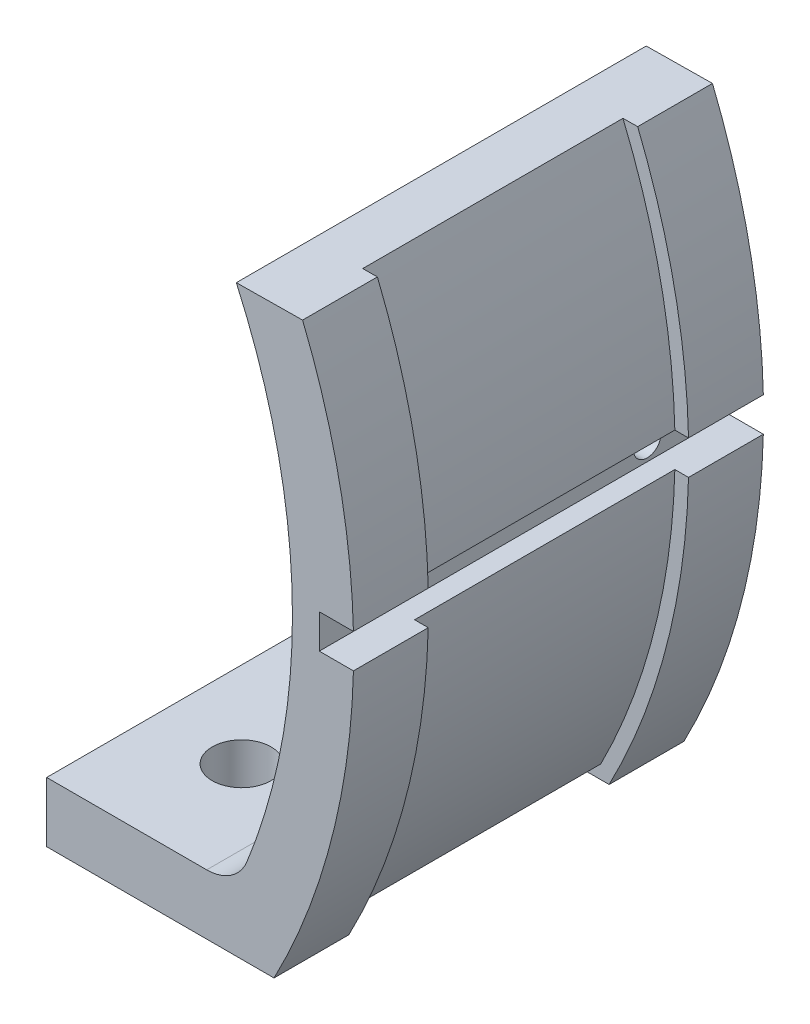
ISO-10303-21;
HEADER;
FILE_DESCRIPTION(('STEP AP214'),'2;1');
FILE_NAME('part.step','',(''),(''),'','','');
FILE_SCHEMA(('AUTOMOTIVE_DESIGN { 1 0 10303 214 1 1 1 1 }'));
ENDSEC;
DATA;
#1=APPLICATION_CONTEXT('core data for automotive mechanical design processes');
#2=APPLICATION_PROTOCOL_DEFINITION('international standard','automotive_design',2000,#1);
#3=PRODUCT_CONTEXT('',#1,'mechanical');
#4=PRODUCT('Part','Part','',(#3));
#5=PRODUCT_RELATED_PRODUCT_CATEGORY('part','',(#4));
#6=PRODUCT_DEFINITION_FORMATION('','',#4);
#7=PRODUCT_DEFINITION_CONTEXT('part definition',#1,'design');
#8=PRODUCT_DEFINITION('design','',#6,#7);
#9=PRODUCT_DEFINITION_SHAPE('','',#8);
#10=(LENGTH_UNIT() NAMED_UNIT(*) SI_UNIT(.MILLI.,.METRE.));
#11=(NAMED_UNIT(*) PLANE_ANGLE_UNIT() SI_UNIT($,.RADIAN.));
#12=(NAMED_UNIT(*) SI_UNIT($,.STERADIAN.) SOLID_ANGLE_UNIT());
#13=UNCERTAINTY_MEASURE_WITH_UNIT(LENGTH_MEASURE(1.E-05),#10,'distance_accuracy_value','');
#14=(GEOMETRIC_REPRESENTATION_CONTEXT(3) GLOBAL_UNCERTAINTY_ASSIGNED_CONTEXT((#13)) GLOBAL_UNIT_ASSIGNED_CONTEXT((#10,
#11,#12)) REPRESENTATION_CONTEXT('',''));
#15=CARTESIAN_POINT('',(0.,0.,0.));
#16=DIRECTION('',(0.,0.,1.));
#17=DIRECTION('',(1.,0.,0.));
#18=AXIS2_PLACEMENT_3D('',#15,#16,#17);
#19=CARTESIAN_POINT('',(27.0636330821714,-23.623454780326,30.));
#20=DIRECTION('',(0.,1.,0.));
#21=DIRECTION('',(-1.,0.,0.));
#22=AXIS2_PLACEMENT_3D('',#19,#20,#21);
#23=PLANE('',#22);
#24=DIRECTION('',(0.,0.,1.));
#25=VECTOR('',#24,1.);
#26=CARTESIAN_POINT('',(28.3336330821714,-23.623454780326,0.));
#27=LINE('',#26,#25);
#28=CARTESIAN_POINT('',(28.3336330821714,-23.623454780326,0.));
#29=VERTEX_POINT('',#28);
#30=CARTESIAN_POINT('',(28.3336330821714,-23.623454780326,5.475));
#31=VERTEX_POINT('',#30);
#32=EDGE_CURVE('E54',#29,#31,#27,.T.);
#33=ORIENTED_EDGE('',*,*,#32,.F.);
#34=DIRECTION('',(1.,0.,0.));
#35=VECTOR('',#34,1.);
#36=CARTESIAN_POINT('',(27.0636330821714,-23.623454780326,0.));
#37=LINE('',#36,#35);
#38=CARTESIAN_POINT('',(44.9729968346759,-23.623454780326,0.));
#39=VERTEX_POINT('',#38);
#40=EDGE_CURVE('E196',#29,#39,#37,.T.);
#41=ORIENTED_EDGE('',*,*,#40,.T.);
#42=DIRECTION('',(0.,0.,-1.));
#43=VECTOR('',#42,1.);
#44=CARTESIAN_POINT('',(44.9729968346759,-23.623454780326,30.));
#45=LINE('',#44,#43);
#46=CARTESIAN_POINT('',(44.9729968346759,-23.623454780326,5.475));
#47=VERTEX_POINT('',#46);
#48=EDGE_CURVE('E235',#47,#39,#45,.T.);
#49=ORIENTED_EDGE('',*,*,#48,.F.);
#50=DIRECTION('',(1.,0.,0.));
#51=VECTOR('',#50,1.);
#52=CARTESIAN_POINT('',(0.,-23.623454780326,5.475));
#53=LINE('',#52,#51);
#54=EDGE_CURVE('E316',#31,#47,#53,.T.);
#55=ORIENTED_EDGE('',*,*,#54,.F.);
#56=EDGE_LOOP('',(#33,#41,#49,#55));
#57=FACE_BOUND('',#56,.T.);
#58=ADVANCED_FACE('F38',(#57),#23,.F.);
#59=CARTESIAN_POINT('',(42.1402325031114,-19.2311651103051,30.));
#60=DIRECTION('',(0.,-1.,0.));
#61=DIRECTION('',(1.,0.,0.));
#62=AXIS2_PLACEMENT_3D('',#59,#60,#61);
#63=PLANE('',#62);
#64=CARTESIAN_POINT('',(34.6019325092272,-19.2311651103051,22.));
#65=DIRECTION('',(0.,1.,0.));
#66=DIRECTION('',(-1.,0.,0.));
#67=AXIS2_PLACEMENT_3D('',#64,#65,#66);
#68=CIRCLE('',#67,2.15);
#69=CARTESIAN_POINT('',(32.4519325092272,-19.2311651103051,22.));
#70=VERTEX_POINT('',#69);
#71=EDGE_CURVE('E384',#70,#70,#68,.T.);
#72=ORIENTED_EDGE('',*,*,#71,.F.);
#73=EDGE_LOOP('',(#72));
#74=FACE_BOUND('',#73,.T.);
#75=CARTESIAN_POINT('',(34.6019325092272,-19.2311651103051,8.));
#76=DIRECTION('',(0.,1.,0.));
#77=DIRECTION('',(-1.,0.,0.));
#78=AXIS2_PLACEMENT_3D('',#75,#76,#77);
#79=CIRCLE('',#78,2.15);
#80=CARTESIAN_POINT('',(32.4519325092272,-19.2311651103051,8.));
#81=VERTEX_POINT('',#80);
#82=EDGE_CURVE('E385',#81,#81,#79,.T.);
#83=ORIENTED_EDGE('',*,*,#82,.F.);
#84=EDGE_LOOP('',(#83));
#85=FACE_BOUND('',#84,.T.);
#86=DIRECTION('',(0.,0.,-1.));
#87=VECTOR('',#86,1.);
#88=CARTESIAN_POINT('',(28.3336330821714,-19.2311651103051,30.));
#89=LINE('',#88,#87);
#90=CARTESIAN_POINT('',(28.3336330821714,-19.2311651103051,30.));
#91=VERTEX_POINT('',#90);
#92=CARTESIAN_POINT('',(28.3336330821714,-19.2311651103051,0.));
#93=VERTEX_POINT('',#92);
#94=EDGE_CURVE('E179',#91,#93,#89,.T.);
#95=ORIENTED_EDGE('',*,*,#94,.F.);
#96=DIRECTION('',(-1.,0.,0.));
#97=VECTOR('',#96,1.);
#98=CARTESIAN_POINT('',(42.1402325031114,-19.2311651103051,30.));
#99=LINE('',#98,#97);
#100=CARTESIAN_POINT('',(40.0472288747826,-19.2311651103051,30.));
#101=VERTEX_POINT('',#100);
#102=EDGE_CURVE('E261',#101,#91,#99,.T.);
#103=ORIENTED_EDGE('',*,*,#102,.F.);
#104=DIRECTION('',(0.,0.,1.));
#105=VECTOR('',#104,1.);
#106=CARTESIAN_POINT('',(40.0472288747826,-19.2311651103051,0.));
#107=LINE('',#106,#105);
#108=CARTESIAN_POINT('',(40.0472288747826,-19.2311651103051,0.));
#109=VERTEX_POINT('',#108);
#110=EDGE_CURVE('E201',#101,#109,#107,.F.);
#111=ORIENTED_EDGE('',*,*,#110,.T.);
#112=DIRECTION('',(-1.,0.,0.));
#113=VECTOR('',#112,1.);
#114=CARTESIAN_POINT('',(42.1402325031114,-19.2311651103051,0.));
#115=LINE('',#114,#113);
#116=EDGE_CURVE('E194',#109,#93,#115,.T.);
#117=ORIENTED_EDGE('',*,*,#116,.T.);
#118=EDGE_LOOP('',(#95,#103,#111,#117));
#119=FACE_BOUND('',#118,.T.);
#120=ADVANCED_FACE('F199',(#74,#85,#119),#63,.F.);
#121=DIRECTION('',(0.,0.,1.));
#122=VECTOR('',#121,1.);
#123=CARTESIAN_POINT('',(28.3336330821714,-23.623454780326,24.525));
#124=LINE('',#123,#122);
#125=CARTESIAN_POINT('',(28.3336330821714,-23.623454780326,24.525));
#126=VERTEX_POINT('',#125);
#127=CARTESIAN_POINT('',(28.3336330821714,-23.623454780326,30.));
#128=VERTEX_POINT('',#127);
#129=EDGE_CURVE('E325',#126,#128,#124,.T.);
#130=ORIENTED_EDGE('',*,*,#129,.F.);
#131=DIRECTION('',(1.,0.,0.));
#132=VECTOR('',#131,1.);
#133=CARTESIAN_POINT('',(0.,-23.623454780326,24.525));
#134=LINE('',#133,#132);
#135=CARTESIAN_POINT('',(44.9729968346759,-23.623454780326,24.525));
#136=VERTEX_POINT('',#135);
#137=EDGE_CURVE('E362',#126,#136,#134,.T.);
#138=ORIENTED_EDGE('',*,*,#137,.T.);
#139=CARTESIAN_POINT('',(44.9729968346759,-23.623454780326,30.));
#140=VERTEX_POINT('',#139);
#141=EDGE_CURVE('E236',#140,#136,#45,.T.);
#142=ORIENTED_EDGE('',*,*,#141,.F.);
#143=DIRECTION('',(1.,0.,0.));
#144=VECTOR('',#143,1.);
#145=CARTESIAN_POINT('',(27.0636330821714,-23.623454780326,30.));
#146=LINE('',#145,#144);
#147=EDGE_CURVE('E263',#128,#140,#146,.T.);
#148=ORIENTED_EDGE('',*,*,#147,.F.);
#149=EDGE_LOOP('',(#130,#138,#142,#148));
#150=FACE_BOUND('',#149,.T.);
#151=ADVANCED_FACE('F422',(#150),#23,.F.);
#152=CARTESIAN_POINT('',(-5.6541657400544E-06,0.00052066918059257,30.));
#153=DIRECTION('',(0.,0.,1.));
#154=DIRECTION('',(1.,0.,0.));
#155=AXIS2_PLACEMENT_3D('',#152,#153,#154);
#156=PLANE('',#155);
#157=ORIENTED_EDGE('',*,*,#102,.T.);
#158=DIRECTION('',(0.,1.,0.));
#159=VECTOR('',#158,1.);
#160=CARTESIAN_POINT('',(28.3336330821714,-23.623454780326,30.));
#161=LINE('',#160,#159);
#162=EDGE_CURVE('E184',#128,#91,#161,.T.);
#163=ORIENTED_EDGE('',*,*,#162,.F.);
#164=ORIENTED_EDGE('',*,*,#147,.T.);
#165=CARTESIAN_POINT('',(-5.6541657400544E-06,0.00052066918059257,30.));
#166=DIRECTION('',(0.,0.,1.));
#167=DIRECTION('',(1.,0.,0.));
#168=AXIS2_PLACEMENT_3D('',#165,#166,#167);
#169=CIRCLE('',#168,50.8002280398449);
#170=CARTESIAN_POINT('',(50.7848315255631,-1.24987188065171,30.));
#171=VERTEX_POINT('',#170);
#172=EDGE_CURVE('E265',#140,#171,#169,.T.);
#173=ORIENTED_EDGE('',*,*,#172,.T.);
#174=DIRECTION('',(-0.999999997135779,-7.56864698825548E-05,0.));
#175=VECTOR('',#174,1.);
#176=CARTESIAN_POINT('',(50.7848315255631,-1.2498718806517,30.));
#177=LINE('',#176,#175);
#178=CARTESIAN_POINT('',(48.2848555051628,-1.25006109501201,30.));
#179=VERTEX_POINT('',#178);
#180=EDGE_CURVE('E272',#171,#179,#177,.T.);
#181=ORIENTED_EDGE('',*,*,#180,.T.);
#182=DIRECTION('',(0.,1.,0.));
#183=VECTOR('',#182,1.);
#184=CARTESIAN_POINT('',(48.2848555051628,-1.25006109501201,30.));
#185=LINE('',#184,#183);
#186=CARTESIAN_POINT('',(48.2848555051628,1.24993890498799,30.));
#187=VERTEX_POINT('',#186);
#188=EDGE_CURVE('E274',#179,#187,#185,.T.);
#189=ORIENTED_EDGE('',*,*,#188,.T.);
#190=DIRECTION('',(1.,0.,0.));
#191=VECTOR('',#190,1.);
#192=CARTESIAN_POINT('',(48.2848555051628,1.24993890498799,30.));
#193=LINE('',#192,#191);
#194=CARTESIAN_POINT('',(50.7848555051628,1.24993890498799,30.));
#195=VERTEX_POINT('',#194);
#196=EDGE_CURVE('E276',#187,#195,#193,.T.);
#197=ORIENTED_EDGE('',*,*,#196,.T.);
#198=CARTESIAN_POINT('',(-5.6541657400544E-06,0.00052066918059257,30.));
#199=DIRECTION('',(0.,0.,1.));
#200=DIRECTION('',(1.,0.,0.));
#201=AXIS2_PLACEMENT_3D('',#198,#199,#200);
#202=CIRCLE('',#201,50.8002280398449);
#203=CARTESIAN_POINT('',(47.0635361596587,19.1234441077829,30.));
#204=VERTEX_POINT('',#203);
#205=EDGE_CURVE('E220',#195,#204,#202,.T.);
#206=ORIENTED_EDGE('',*,*,#205,.T.);
#207=DIRECTION('',(-0.999939359206441,-0.0110126250191067,0.));
#208=VECTOR('',#207,1.);
#209=CARTESIAN_POINT('',(47.0635361596587,19.1234441077829,30.));
#210=LINE('',#209,#208);
#211=CARTESIAN_POINT('',(42.2138676383075,19.0700332880158,30.));
#212=VERTEX_POINT('',#211);
#213=EDGE_CURVE('E267',#204,#212,#210,.T.);
#214=ORIENTED_EDGE('',*,*,#213,.T.);
#215=CARTESIAN_POINT('',(-5.6541657400544E-06,0.00052066918059257,30.));
#216=DIRECTION('',(0.,0.,-1.));
#217=DIRECTION('',(1.,0.,0.));
#218=AXIS2_PLACEMENT_3D('',#215,#216,#217);
#219=CIRCLE('',#218,46.3212414543577);
#220=CARTESIAN_POINT('',(42.9941824295648,-17.2377275275969,30.));
#221=VERTEX_POINT('',#220);
#222=EDGE_CURVE('E262',#212,#221,#219,.T.);
#223=ORIENTED_EDGE('',*,*,#222,.T.);
#224=CARTESIAN_POINT('',(40.0472288747826,-16.0561651103051,30.));
#225=DIRECTION('',(0.,0.,1.));
#226=DIRECTION('',(1.,0.,0.));
#227=AXIS2_PLACEMENT_3D('',#224,#225,#226);
#228=CIRCLE('',#227,3.175);
#229=EDGE_CURVE('E11',#221,#101,#228,.F.);
#230=ORIENTED_EDGE('',*,*,#229,.T.);
#231=EDGE_LOOP('',(#157,#163,#164,#173,#181,#189,#197,#206,#214,#223,#230));
#232=FACE_BOUND('',#231,.T.);
#233=ADVANCED_FACE('F260',(#232),#156,.T.);
#234=CARTESIAN_POINT('',(-5.6541657400544E-06,0.00052066918059257,0.));
#235=DIRECTION('',(0.,0.,1.));
#236=DIRECTION('',(1.,0.,0.));
#237=AXIS2_PLACEMENT_3D('',#234,#235,#236);
#238=PLANE('',#237);
#239=DIRECTION('',(0.,-1.,0.));
#240=VECTOR('',#239,1.);
#241=CARTESIAN_POINT('',(28.3336330821714,-19.2311651103051,0.));
#242=LINE('',#241,#240);
#243=EDGE_CURVE('E182',#93,#29,#242,.T.);
#244=ORIENTED_EDGE('',*,*,#243,.F.);
#245=ORIENTED_EDGE('',*,*,#116,.F.);
#246=CARTESIAN_POINT('',(40.0472288747826,-16.0561651103051,0.));
#247=DIRECTION('',(0.,0.,1.));
#248=DIRECTION('',(1.,0.,0.));
#249=AXIS2_PLACEMENT_3D('',#246,#247,#248);
#250=CIRCLE('',#249,3.175);
#251=CARTESIAN_POINT('',(42.9941824295648,-17.2377275275969,0.));
#252=VERTEX_POINT('',#251);
#253=EDGE_CURVE('E47',#109,#252,#250,.T.);
#254=ORIENTED_EDGE('',*,*,#253,.T.);
#255=CARTESIAN_POINT('',(-5.6541657400544E-06,0.00052066918059257,0.));
#256=DIRECTION('',(0.,0.,-1.));
#257=DIRECTION('',(1.,0.,0.));
#258=AXIS2_PLACEMENT_3D('',#255,#256,#257);
#259=CIRCLE('',#258,46.3212414543577);
#260=CARTESIAN_POINT('',(42.2138676383075,19.0700332880158,0.));
#261=VERTEX_POINT('',#260);
#262=EDGE_CURVE('E202',#261,#252,#259,.T.);
#263=ORIENTED_EDGE('',*,*,#262,.F.);
#264=DIRECTION('',(-0.999939359206441,-0.0110126250191067,0.));
#265=VECTOR('',#264,1.);
#266=CARTESIAN_POINT('',(47.0635361596587,19.1234441077829,0.));
#267=LINE('',#266,#265);
#268=CARTESIAN_POINT('',(47.0635361596587,19.1234441077829,0.));
#269=VERTEX_POINT('',#268);
#270=EDGE_CURVE('E207',#269,#261,#267,.T.);
#271=ORIENTED_EDGE('',*,*,#270,.F.);
#272=CARTESIAN_POINT('',(-5.6541657400544E-06,0.00052066918059257,0.));
#273=DIRECTION('',(0.,0.,1.));
#274=DIRECTION('',(1.,0.,0.));
#275=AXIS2_PLACEMENT_3D('',#272,#273,#274);
#276=CIRCLE('',#275,50.8002280398449);
#277=CARTESIAN_POINT('',(50.7848555051628,1.24993890498799,0.));
#278=VERTEX_POINT('',#277);
#279=EDGE_CURVE('E278',#278,#269,#276,.T.);
#280=ORIENTED_EDGE('',*,*,#279,.F.);
#281=DIRECTION('',(1.,0.,0.));
#282=VECTOR('',#281,1.);
#283=CARTESIAN_POINT('',(48.2848555051628,1.24993890498799,0.));
#284=LINE('',#283,#282);
#285=CARTESIAN_POINT('',(48.2848555051628,1.24993890498799,0.));
#286=VERTEX_POINT('',#285);
#287=EDGE_CURVE('E217',#286,#278,#284,.T.);
#288=ORIENTED_EDGE('',*,*,#287,.F.);
#289=DIRECTION('',(0.,1.,0.));
#290=VECTOR('',#289,1.);
#291=CARTESIAN_POINT('',(48.2848555051628,-1.25006109501201,0.));
#292=LINE('',#291,#290);
#293=CARTESIAN_POINT('',(48.2848555051628,-1.25006109501201,0.));
#294=VERTEX_POINT('',#293);
#295=EDGE_CURVE('E215',#294,#286,#292,.T.);
#296=ORIENTED_EDGE('',*,*,#295,.F.);
#297=DIRECTION('',(-0.999999997135779,-7.56864698825548E-05,0.));
#298=VECTOR('',#297,1.);
#299=CARTESIAN_POINT('',(50.7848315255631,-1.2498718806517,0.));
#300=LINE('',#299,#298);
#301=CARTESIAN_POINT('',(50.7848315255631,-1.24987188065171,0.));
#302=VERTEX_POINT('',#301);
#303=EDGE_CURVE('E213',#302,#294,#300,.T.);
#304=ORIENTED_EDGE('',*,*,#303,.F.);
#305=CARTESIAN_POINT('',(-5.6541657400544E-06,0.00052066918059257,0.));
#306=DIRECTION('',(0.,0.,1.));
#307=DIRECTION('',(1.,0.,0.));
#308=AXIS2_PLACEMENT_3D('',#305,#306,#307);
#309=CIRCLE('',#308,50.8002280398449);
#310=EDGE_CURVE('E204',#39,#302,#309,.T.);
#311=ORIENTED_EDGE('',*,*,#310,.F.);
#312=ORIENTED_EDGE('',*,*,#40,.F.);
#313=EDGE_LOOP('',(#244,#245,#254,#263,#271,#280,#288,#296,#304,#311,#312));
#314=FACE_BOUND('',#313,.T.);
#315=ADVANCED_FACE('F193',(#314),#238,.F.);
#316=CARTESIAN_POINT('',(0.,-22.6234547803261,24.525));
#317=DIRECTION('',(0.,-1.,0.));
#318=DIRECTION('',(1.,0.,0.));
#319=AXIS2_PLACEMENT_3D('',#316,#317,#318);
#320=PLANE('',#319);
#321=CARTESIAN_POINT('',(34.6019325092272,-22.623454780326,8.));
#322=DIRECTION('',(0.,-1.,0.));
#323=DIRECTION('',(1.,0.,0.));
#324=AXIS2_PLACEMENT_3D('',#321,#322,#323);
#325=CIRCLE('',#324,2.15);
#326=CARTESIAN_POINT('',(36.7519325092272,-22.623454780326,8.));
#327=VERTEX_POINT('',#326);
#328=EDGE_CURVE('E42',#327,#327,#325,.F.);
#329=ORIENTED_EDGE('',*,*,#328,.T.);
#330=EDGE_LOOP('',(#329));
#331=FACE_BOUND('',#330,.T.);
#332=CARTESIAN_POINT('',(34.6019325092272,-22.623454780326,22.));
#333=DIRECTION('',(0.,-1.,0.));
#334=DIRECTION('',(1.,0.,0.));
#335=AXIS2_PLACEMENT_3D('',#332,#333,#334);
#336=CIRCLE('',#335,2.15);
#337=CARTESIAN_POINT('',(36.7519325092272,-22.623454780326,22.));
#338=VERTEX_POINT('',#337);
#339=EDGE_CURVE('E381',#338,#338,#336,.F.);
#340=ORIENTED_EDGE('',*,*,#339,.T.);
#341=EDGE_LOOP('',(#340));
#342=FACE_BOUND('',#341,.T.);
#343=DIRECTION('',(-1.,0.,0.));
#344=VECTOR('',#343,1.);
#345=CARTESIAN_POINT('',(0.,-22.6234547803261,24.525));
#346=LINE('',#345,#344);
#347=CARTESIAN_POINT('',(44.3643464188683,-22.623454780326,24.525));
#348=VERTEX_POINT('',#347);
#349=CARTESIAN_POINT('',(28.3336330821714,-22.623454780326,24.525));
#350=VERTEX_POINT('',#349);
#351=EDGE_CURVE('E359',#348,#350,#346,.T.);
#352=ORIENTED_EDGE('',*,*,#351,.T.);
#353=DIRECTION('',(0.,0.,1.));
#354=VECTOR('',#353,1.);
#355=CARTESIAN_POINT('',(28.3336330821714,-22.623454780326,5.475));
#356=LINE('',#355,#354);
#357=CARTESIAN_POINT('',(28.3336330821714,-22.623454780326,5.475));
#358=VERTEX_POINT('',#357);
#359=EDGE_CURVE('E319',#358,#350,#356,.T.);
#360=ORIENTED_EDGE('',*,*,#359,.F.);
#361=DIRECTION('',(-1.,0.,0.));
#362=VECTOR('',#361,1.);
#363=CARTESIAN_POINT('',(0.,-22.6234547803261,5.475));
#364=LINE('',#363,#362);
#365=CARTESIAN_POINT('',(44.3643464188683,-22.623454780326,5.475));
#366=VERTEX_POINT('',#365);
#367=EDGE_CURVE('E373',#366,#358,#364,.T.);
#368=ORIENTED_EDGE('',*,*,#367,.F.);
#369=DIRECTION('',(0.,0.,-1.));
#370=VECTOR('',#369,1.);
#371=CARTESIAN_POINT('',(44.3643464188683,-22.623454780326,24.525));
#372=LINE('',#371,#370);
#373=EDGE_CURVE('E345',#348,#366,#372,.T.);
#374=ORIENTED_EDGE('',*,*,#373,.F.);
#375=EDGE_LOOP('',(#352,#360,#368,#374));
#376=FACE_BOUND('',#375,.T.);
#377=ADVANCED_FACE('F425',(#331,#342,#376),#320,.T.);
#378=CARTESIAN_POINT('',(0.,0.,24.525));
#379=DIRECTION('',(0.,0.,1.));
#380=DIRECTION('',(1.,0.,0.));
#381=AXIS2_PLACEMENT_3D('',#378,#379,#380);
#382=PLANE('',#381);
#383=DIRECTION('',(0.,-1.,0.));
#384=VECTOR('',#383,1.);
#385=CARTESIAN_POINT('',(28.3336330821714,-22.623454780326,24.525));
#386=LINE('',#385,#384);
#387=EDGE_CURVE('E323',#350,#126,#386,.T.);
#388=ORIENTED_EDGE('',*,*,#387,.F.);
#389=ORIENTED_EDGE('',*,*,#351,.F.);
#390=CARTESIAN_POINT('',(-5.6541657400544E-06,0.00052066918059257,24.525));
#391=DIRECTION('',(0.,0.,1.));
#392=DIRECTION('',(1.,0.,0.));
#393=AXIS2_PLACEMENT_3D('',#390,#391,#392);
#394=CIRCLE('',#393,49.8);
#395=CARTESIAN_POINT('',(49.7842923632608,-1.24994760792909,24.525));
#396=VERTEX_POINT('',#395);
#397=EDGE_CURVE('E356',#348,#396,#394,.T.);
#398=ORIENTED_EDGE('',*,*,#397,.T.);
#399=DIRECTION('',(-0.999999997135779,-7.56864698826048E-05,0.));
#400=VECTOR('',#399,1.);
#401=CARTESIAN_POINT('',(9.48893081289299E-05,-1.25371559810262,24.525));
#402=LINE('',#401,#400);
#403=CARTESIAN_POINT('',(50.7848315255631,-1.2498718806517,24.525));
#404=VERTEX_POINT('',#403);
#405=EDGE_CURVE('E367',#404,#396,#402,.T.);
#406=ORIENTED_EDGE('',*,*,#405,.F.);
#407=CARTESIAN_POINT('',(-5.6541657400544E-06,0.00052066918059257,24.525));
#408=DIRECTION('',(0.,0.,1.));
#409=DIRECTION('',(1.,0.,0.));
#410=AXIS2_PLACEMENT_3D('',#407,#408,#409);
#411=CIRCLE('',#410,50.8002280398449);
#412=EDGE_CURVE('E364',#136,#404,#411,.T.);
#413=ORIENTED_EDGE('',*,*,#412,.F.);
#414=ORIENTED_EDGE('',*,*,#137,.F.);
#415=EDGE_LOOP('',(#388,#389,#398,#406,#413,#414));
#416=FACE_BOUND('',#415,.T.);
#417=ADVANCED_FACE('F459',(#416),#382,.F.);
#418=CARTESIAN_POINT('',(0.,0.,5.475));
#419=DIRECTION('',(0.,0.,1.));
#420=DIRECTION('',(1.,0.,0.));
#421=AXIS2_PLACEMENT_3D('',#418,#419,#420);
#422=PLANE('',#421);
#423=ORIENTED_EDGE('',*,*,#367,.T.);
#424=DIRECTION('',(0.,1.,0.));
#425=VECTOR('',#424,1.);
#426=CARTESIAN_POINT('',(28.3336330821714,-23.623454780326,5.475));
#427=LINE('',#426,#425);
#428=EDGE_CURVE('E317',#31,#358,#427,.T.);
#429=ORIENTED_EDGE('',*,*,#428,.F.);
#430=ORIENTED_EDGE('',*,*,#54,.T.);
#431=CARTESIAN_POINT('',(-5.6541657400544E-06,0.00052066918059257,5.475));
#432=DIRECTION('',(0.,0.,1.));
#433=DIRECTION('',(1.,0.,0.));
#434=AXIS2_PLACEMENT_3D('',#431,#432,#433);
#435=CIRCLE('',#434,50.8002280398449);
#436=CARTESIAN_POINT('',(50.7848315255631,-1.24987188065171,5.475));
#437=VERTEX_POINT('',#436);
#438=EDGE_CURVE('E62',#47,#437,#435,.T.);
#439=ORIENTED_EDGE('',*,*,#438,.T.);
#440=DIRECTION('',(-0.999999997135779,-7.56864698826048E-05,0.));
#441=VECTOR('',#440,1.);
#442=CARTESIAN_POINT('',(9.48893081289299E-05,-1.25371559810262,5.475));
#443=LINE('',#442,#441);
#444=CARTESIAN_POINT('',(49.7842923632608,-1.24994760792909,5.475));
#445=VERTEX_POINT('',#444);
#446=EDGE_CURVE('E309',#437,#445,#443,.T.);
#447=ORIENTED_EDGE('',*,*,#446,.T.);
#448=CARTESIAN_POINT('',(-5.6541657400544E-06,0.00052066918059257,5.475));
#449=DIRECTION('',(0.,0.,1.));
#450=DIRECTION('',(1.,0.,0.));
#451=AXIS2_PLACEMENT_3D('',#448,#449,#450);
#452=CIRCLE('',#451,49.8);
#453=EDGE_CURVE('E328',#366,#445,#452,.T.);
#454=ORIENTED_EDGE('',*,*,#453,.F.);
#455=EDGE_LOOP('',(#423,#429,#430,#439,#447,#454));
#456=FACE_BOUND('',#455,.T.);
#457=ADVANCED_FACE('F504',(#456),#422,.T.);
#458=CARTESIAN_POINT('',(-5.6541657400544E-06,0.00052066918059257,30.));
#459=DIRECTION('',(0.,0.,-1.));
#460=DIRECTION('',(-1.,0.,0.));
#461=AXIS2_PLACEMENT_3D('',#458,#459,#460);
#462=CYLINDRICAL_SURFACE('',#461,50.8002280398449);
#463=CARTESIAN_POINT('',(-5.6541657400544E-06,0.00052066918059257,5.475));
#464=DIRECTION('',(0.,0.,1.));
#465=DIRECTION('',(1.,0.,0.));
#466=AXIS2_PLACEMENT_3D('',#463,#464,#465);
#467=CIRCLE('',#466,50.8002280398449);
#468=CARTESIAN_POINT('',(50.7848555051628,1.24993890498799,5.475));
#469=VERTEX_POINT('',#468);
#470=CARTESIAN_POINT('',(47.0635361596587,19.1234441077829,5.475));
#471=VERTEX_POINT('',#470);
#472=EDGE_CURVE('E291',#469,#471,#467,.T.);
#473=ORIENTED_EDGE('',*,*,#472,.F.);
#474=DIRECTION('',(0.,0.,-1.));
#475=VECTOR('',#474,1.);
#476=CARTESIAN_POINT('',(50.7848555051628,1.24993890498799,30.));
#477=LINE('',#476,#475);
#478=EDGE_CURVE('E225',#469,#278,#477,.T.);
#479=ORIENTED_EDGE('',*,*,#478,.T.);
#480=ORIENTED_EDGE('',*,*,#279,.T.);
#481=DIRECTION('',(0.,0.,-1.));
#482=VECTOR('',#481,1.);
#483=CARTESIAN_POINT('',(47.0635361596587,19.1234441077829,30.));
#484=LINE('',#483,#482);
#485=EDGE_CURVE('E242',#471,#269,#484,.T.);
#486=ORIENTED_EDGE('',*,*,#485,.F.);
#487=EDGE_LOOP('',(#473,#479,#480,#486));
#488=FACE_BOUND('',#487,.T.);
#489=ADVANCED_FACE('F289',(#488),#462,.T.);
#490=CARTESIAN_POINT('',(-5.6541657400544E-06,0.00052066918059257,30.));
#491=DIRECTION('',(0.,0.,-1.));
#492=DIRECTION('',(-1.,0.,0.));
#493=AXIS2_PLACEMENT_3D('',#490,#491,#492);
#494=CYLINDRICAL_SURFACE('',#493,50.8002280398449);
#495=ORIENTED_EDGE('',*,*,#438,.F.);
#496=ORIENTED_EDGE('',*,*,#48,.T.);
#497=ORIENTED_EDGE('',*,*,#310,.T.);
#498=DIRECTION('',(0.,0.,-1.));
#499=VECTOR('',#498,1.);
#500=CARTESIAN_POINT('',(50.7848315255631,-1.24987188065171,30.));
#501=LINE('',#500,#499);
#502=EDGE_CURVE('E231',#437,#302,#501,.T.);
#503=ORIENTED_EDGE('',*,*,#502,.F.);
#504=EDGE_LOOP('',(#495,#496,#497,#503));
#505=FACE_BOUND('',#504,.T.);
#506=ADVANCED_FACE('F312',(#505),#494,.T.);
#507=CARTESIAN_POINT('',(34.6019325092272,-23.623454780326,22.));
#508=DIRECTION('',(0.,1.,0.));
#509=DIRECTION('',(-1.,0.,0.));
#510=AXIS2_PLACEMENT_3D('',#507,#508,#509);
#511=CYLINDRICAL_SURFACE('',#510,2.15);
#512=ORIENTED_EDGE('',*,*,#71,.T.);
#513=EDGE_LOOP('',(#512));
#514=FACE_BOUND('',#513,.T.);
#515=ORIENTED_EDGE('',*,*,#339,.F.);
#516=EDGE_LOOP('',(#515));
#517=FACE_BOUND('',#516,.T.);
#518=ADVANCED_FACE('F452',(#514,#517),#511,.F.);
#519=CARTESIAN_POINT('',(34.6019325092272,-23.623454780326,8.));
#520=DIRECTION('',(0.,1.,0.));
#521=DIRECTION('',(-1.,0.,0.));
#522=AXIS2_PLACEMENT_3D('',#519,#520,#521);
#523=CYLINDRICAL_SURFACE('',#522,2.15);
#524=ORIENTED_EDGE('',*,*,#82,.T.);
#525=EDGE_LOOP('',(#524));
#526=FACE_BOUND('',#525,.T.);
#527=ORIENTED_EDGE('',*,*,#328,.F.);
#528=EDGE_LOOP('',(#527));
#529=FACE_BOUND('',#528,.T.);
#530=ADVANCED_FACE('F448',(#526,#529),#523,.F.);
#531=CARTESIAN_POINT('',(50.7848555051628,1.24993890498799,24.525));
#532=VERTEX_POINT('',#531);
#533=EDGE_CURVE('E221',#195,#532,#477,.T.);
#534=ORIENTED_EDGE('',*,*,#533,.T.);
#535=CARTESIAN_POINT('',(-5.6541657400544E-06,0.00052066918059257,24.525));
#536=DIRECTION('',(0.,0.,1.));
#537=DIRECTION('',(1.,0.,0.));
#538=AXIS2_PLACEMENT_3D('',#535,#536,#537);
#539=CIRCLE('',#538,50.8002280398449);
#540=CARTESIAN_POINT('',(47.0635361596587,19.1234441077829,24.525));
#541=VERTEX_POINT('',#540);
#542=EDGE_CURVE('E332',#532,#541,#539,.T.);
#543=ORIENTED_EDGE('',*,*,#542,.T.);
#544=EDGE_CURVE('E243',#204,#541,#484,.T.);
#545=ORIENTED_EDGE('',*,*,#544,.F.);
#546=ORIENTED_EDGE('',*,*,#205,.F.);
#547=EDGE_LOOP('',(#534,#543,#545,#546));
#548=FACE_BOUND('',#547,.T.);
#549=ADVANCED_FACE('F451',(#548),#462,.T.);
#550=CARTESIAN_POINT('',(47.0635361596587,19.1234441077829,30.));
#551=DIRECTION('',(0.0110126250191067,-0.999939359206441,0.));
#552=DIRECTION('',(0.999939359206441,0.0110126250191067,0.));
#553=AXIS2_PLACEMENT_3D('',#550,#551,#552);
#554=PLANE('',#553);
#555=ORIENTED_EDGE('',*,*,#544,.T.);
#556=DIRECTION('',(-0.999939359206441,-0.0110126250191054,0.));
#557=VECTOR('',#556,1.);
#558=CARTESIAN_POINT('',(-0.204878780829226,18.6028632103571,24.525));
#559=LINE('',#558,#557);
#560=CARTESIAN_POINT('',(45.9870261948375,19.1115881882586,24.525));
#561=VERTEX_POINT('',#560);
#562=EDGE_CURVE('E336',#541,#561,#559,.T.);
#563=ORIENTED_EDGE('',*,*,#562,.T.);
#564=DIRECTION('',(0.,0.,-1.));
#565=VECTOR('',#564,1.);
#566=CARTESIAN_POINT('',(45.9870261948375,19.1115881882586,24.525));
#567=LINE('',#566,#565);
#568=CARTESIAN_POINT('',(45.9870261948375,19.1115881882586,5.475));
#569=VERTEX_POINT('',#568);
#570=EDGE_CURVE('E353',#561,#569,#567,.T.);
#571=ORIENTED_EDGE('',*,*,#570,.T.);
#572=DIRECTION('',(-0.999939359206441,-0.0110126250191054,0.));
#573=VECTOR('',#572,1.);
#574=CARTESIAN_POINT('',(-0.204878780829226,18.6028632103571,5.475));
#575=LINE('',#574,#573);
#576=EDGE_CURVE('E347',#471,#569,#575,.T.);
#577=ORIENTED_EDGE('',*,*,#576,.F.);
#578=ORIENTED_EDGE('',*,*,#485,.T.);
#579=ORIENTED_EDGE('',*,*,#270,.T.);
#580=DIRECTION('',(0.,0.,-1.));
#581=VECTOR('',#580,1.);
#582=CARTESIAN_POINT('',(42.2138676383075,19.0700332880158,30.));
#583=LINE('',#582,#581);
#584=EDGE_CURVE('E239',#212,#261,#583,.T.);
#585=ORIENTED_EDGE('',*,*,#584,.F.);
#586=ORIENTED_EDGE('',*,*,#213,.F.);
#587=EDGE_LOOP('',(#555,#563,#571,#577,#578,#579,#585,#586));
#588=FACE_BOUND('',#587,.T.);
#589=ADVANCED_FACE('F282',(#588),#554,.F.);
#590=CARTESIAN_POINT('',(-5.6541657400544E-06,0.00052066918059257,30.));
#591=DIRECTION('',(0.,0.,-1.));
#592=DIRECTION('',(-1.,0.,0.));
#593=AXIS2_PLACEMENT_3D('',#590,#591,#592);
#594=CYLINDRICAL_SURFACE('',#593,46.3212414543577);
#595=CARTESIAN_POINT('',(46.3104529169048,0.999938904987977,24.));
#596=CARTESIAN_POINT('',(46.3104530627026,0.999936416533772,24.0561634262543));
#597=CARTESIAN_POINT('',(46.3105561236335,0.995191530195956,24.1123674097101));
#598=CARTESIAN_POINT('',(46.3109573335317,0.976329350766671,24.2232270081859));
#599=CARTESIAN_POINT('',(46.3112557163875,0.962200820927456,24.2778806848247));
#600=CARTESIAN_POINT('',(46.3120137382692,0.924974180271999,24.3840175808598));
#601=CARTESIAN_POINT('',(46.3124732992975,0.901880407359554,24.4355023196351));
#602=CARTESIAN_POINT('',(46.3135017696689,0.847384923069326,24.5338496820738));
#603=CARTESIAN_POINT('',(46.3140706520697,0.815985257971871,24.5807134402863));
#604=CARTESIAN_POINT('',(46.3152538376262,0.745757559252458,24.6685174027703));
#605=CARTESIAN_POINT('',(46.3158681521048,0.706927669961388,24.7094561227915));
#606=CARTESIAN_POINT('',(46.3170728190378,0.622944539167829,24.7842355784073));
#607=CARTESIAN_POINT('',(46.3176631705436,0.577791047664015,24.8180760332422));
#608=CARTESIAN_POINT('',(46.3187533372154,0.482439114903568,24.8776989778868));
#609=CARTESIAN_POINT('',(46.3192531452484,0.432240276656475,24.9034808329527));
#610=CARTESIAN_POINT('',(46.3201057624469,0.328225495187337,24.9462504859857));
#611=CARTESIAN_POINT('',(46.32045857206,0.274409562981923,24.9632383107355));
#612=CARTESIAN_POINT('',(46.3209773139695,0.164697097697396,24.9879351866212));
#613=CARTESIAN_POINT('',(46.3211432754352,0.108800890783218,24.9956456860771));
#614=CARTESIAN_POINT('',(46.32126965009,-0.00349275164302151,25.0015734921035));
#615=CARTESIAN_POINT('',(46.3212300638821,-0.0598901856840486,24.999790826526));
#616=CARTESIAN_POINT('',(46.3209497717324,-0.171575551059573,24.9867841565733));
#617=CARTESIAN_POINT('',(46.3207090992184,-0.226863665239656,24.9755617214331));
#618=CARTESIAN_POINT('',(46.3200537431073,-0.334770976805925,24.9439965001963));
#619=CARTESIAN_POINT('',(46.319639059223,-0.387390169788301,24.9236536990513));
#620=CARTESIAN_POINT('',(46.3186823112017,-0.488470990555281,24.8744234004877));
#621=CARTESIAN_POINT('',(46.3181402362929,-0.536932266292444,24.8455351804547));
#622=CARTESIAN_POINT('',(46.3169897573138,-0.628317723951062,24.780034630152));
#623=CARTESIAN_POINT('',(46.3163813531779,-0.671241900395297,24.7434222922419));
#624=CARTESIAN_POINT('',(46.3151666021044,-0.75034386799058,24.6635038947062));
#625=CARTESIAN_POINT('',(46.3145602556125,-0.786520279636758,24.6201964696475));
#626=CARTESIAN_POINT('',(46.3134180670819,-0.851089171337764,24.5281220707519));
#627=CARTESIAN_POINT('',(46.3128822250536,-0.879481650261614,24.4793550961217));
#628=CARTESIAN_POINT('',(46.3119414405798,-0.927676540580914,24.3777451849108));
#629=CARTESIAN_POINT('',(46.3115364987603,-0.947478910899689,24.3249022288406));
#630=CARTESIAN_POINT('',(46.3109031789805,-0.977930588091044,24.2166407315345));
#631=CARTESIAN_POINT('',(46.3106748007669,-0.988579908088082,24.1612221939916));
#632=CARTESIAN_POINT('',(46.3104203913852,-1.00042149614909,24.0493946889948));
#633=CARTESIAN_POINT('',(46.3103943193204,-1.00161567558764,23.992985924028));
#634=CARTESIAN_POINT('',(46.3105473538939,-0.994518062686753,23.8807686829819));
#635=CARTESIAN_POINT('',(46.3107264604135,-0.986226275836964,23.8249602065553));
#636=CARTESIAN_POINT('',(46.3112696319915,-0.960393688457429,23.7155330853469));
#637=CARTESIAN_POINT('',(46.3116336797223,-0.942853754404737,23.6619142359217));
#638=CARTESIAN_POINT('',(46.3125056962388,-0.899023654532265,23.5583821578234));
#639=CARTESIAN_POINT('',(46.3130136651656,-0.872733480125238,23.5084689327871));
#640=CARTESIAN_POINT('',(46.3141163855133,-0.812144262731745,23.4137561708267));
#641=CARTESIAN_POINT('',(46.3147111508784,-0.777843932338434,23.3689574576414));
#642=CARTESIAN_POINT('',(46.315920399445,-0.702209961403529,23.2857536691679));
#643=CARTESIAN_POINT('',(46.3165348826764,-0.66087631018947,23.2473486035818));
#644=CARTESIAN_POINT('',(46.3177144552254,-0.572340839833579,23.178015940286));
#645=CARTESIAN_POINT('',(46.3182795363851,-0.525138054616,23.1470895760652));
#646=CARTESIAN_POINT('',(46.319296534461,-0.426209213608224,23.093600658543));
#647=CARTESIAN_POINT('',(46.3197484515668,-0.374483165398997,23.0710380912244));
#648=CARTESIAN_POINT('',(46.3204881912962,-0.267980766808931,23.0349193838376));
#649=CARTESIAN_POINT('',(46.320776028503,-0.213204687984368,23.0213624433482));
#650=CARTESIAN_POINT('',(46.3211552755745,-0.10215323227226,23.0036371935165));
#651=CARTESIAN_POINT('',(46.3212466853577,-0.0458778547623734,22.9994688880714));
#652=CARTESIAN_POINT('',(46.3212228325485,0.0665623059963303,23.0006393439047));
#653=CARTESIAN_POINT('',(46.3211076123448,0.122727109562465,23.0059761552728));
#654=CARTESIAN_POINT('',(46.3206836285161,0.233363420038951,23.0260013605119));
#655=CARTESIAN_POINT('',(46.3203748645048,0.287834923570841,23.0406897730398));
#656=CARTESIAN_POINT('',(46.3195986411787,0.393539532286562,23.0790011242715));
#657=CARTESIAN_POINT('',(46.319131179059,0.444772580215173,23.1026242208872));
#658=CARTESIAN_POINT('',(46.3180903118124,0.542543972973666,23.158133205919));
#659=CARTESIAN_POINT('',(46.3175169106756,0.589082494508389,23.190018783169));
#660=CARTESIAN_POINT('',(46.3163287462184,0.676151565912814,23.2611514781176));
#661=CARTESIAN_POINT('',(46.3157139788307,0.716681523711826,23.3003993204157));
#662=CARTESIAN_POINT('',(46.3145123070615,0.790587795951344,23.3851537097671));
#663=CARTESIAN_POINT('',(46.3139254096296,0.823962333342362,23.4306618069595));
#664=CARTESIAN_POINT('',(46.312845542163,0.88261341708334,23.526657924364));
#665=CARTESIAN_POINT('',(46.3123526254583,0.907885371069458,23.5771487475488));
#666=CARTESIAN_POINT('',(46.3115173655841,0.949564474876371,23.6816183984097));
#667=CARTESIAN_POINT('',(46.3111748424907,0.965982222856549,23.7355929690911));
#668=CARTESIAN_POINT('',(46.3107708060806,0.985124038584476,23.8249249657641));
#669=CARTESIAN_POINT('',(46.3106521136522,0.990672650576675,23.8597022504958));
#670=CARTESIAN_POINT('',(46.310493123402,0.998080862957988,23.9296477179498));
#671=CARTESIAN_POINT('',(46.3104528255684,0.999940463903198,23.9648159006132));
#672=CARTESIAN_POINT('',(46.3104529169048,0.999938904987977,24.));
#673=B_SPLINE_CURVE_WITH_KNOTS('',3,(#595,#596,#597,#598,#599,#600,#601,#602,#603,#604,#605,
#606,#607,#608,#609,#610,#611,#612,#613,#614,#615,#616,#617,#618,#619,#620,#621,#622,#623,#624,
#625,#626,#627,#628,#629,#630,#631,#632,#633,#634,#635,#636,#637,#638,#639,#640,#641,#642,#643,
#644,#645,#646,#647,#648,#649,#650,#651,#652,#653,#654,#655,#656,#657,#658,#659,#660,#661,#662,
#663,#664,#665,#666,#667,#668,#669,#670,#671,#672),.UNSPECIFIED.,.T.,.F.,(4,2,2,2,2,2,2,2,2,2,2,
2,2,2,2,2,2,2,2,2,2,2,2,2,2,2,2,2,2,2,2,2,2,2,2,2,2,2,4),(0.,0.16836185449486,0.336925683724356,
0.505408053463591,0.6738489536567,0.842331976333201,1.01082166180635,1.17932461519637,
1.34782705539795,1.51630318660061,1.68477882351136,1.85322645914238,2.02167437270856,
2.19013653457561,2.35859886308171,2.52709559416447,2.69559234972921,2.86408991101255,
3.03258723068871,3.20105048744244,3.36951364670436,3.53796102512637,3.70640856885855,
3.87488320444168,4.04335809567299,4.21186075514198,4.3803631322066,4.54885053075303,
4.7173379992376,4.88579090764032,5.05424415211764,5.22270037398078,5.39115025268097,
5.5596167190457,5.72812497573646,5.89672857100894,6.06512990351662,6.17060176500224,
6.27607361058861),.UNSPECIFIED.);
#674=CARTESIAN_POINT('',(46.3104529169048,0.999938904987977,24.));
#675=VERTEX_POINT('',#674);
#676=EDGE_CURVE('E280',#675,#675,#673,.T.);
#677=ORIENTED_EDGE('',*,*,#676,.T.);
#678=EDGE_LOOP('',(#677));
#679=FACE_BOUND('',#678,.T.);
#680=CARTESIAN_POINT('',(46.3104529169048,0.999938904987979,6.));
#681=CARTESIAN_POINT('',(46.3104530627026,0.999936416533774,6.05616342625428));
#682=CARTESIAN_POINT('',(46.3105561236335,0.995191530195958,6.11236740971014));
#683=CARTESIAN_POINT('',(46.3109573335317,0.976329350766672,6.2232270081859));
#684=CARTESIAN_POINT('',(46.3112557163875,0.962200820927457,6.27788068482472));
#685=CARTESIAN_POINT('',(46.3120137382692,0.924974180272,6.38401758085979));
#686=CARTESIAN_POINT('',(46.3124732992975,0.901880407359555,6.43550231963506));
#687=CARTESIAN_POINT('',(46.3135017696689,0.847384923069328,6.5338496820738));
#688=CARTESIAN_POINT('',(46.3140706520697,0.815985257971873,6.58071344028626));
#689=CARTESIAN_POINT('',(46.3152538376262,0.745757559252458,6.66851740277026));
#690=CARTESIAN_POINT('',(46.3158681521048,0.706927669961388,6.70945612279154));
#691=CARTESIAN_POINT('',(46.3170728190378,0.622944539167829,6.78423557840727));
#692=CARTESIAN_POINT('',(46.3176631705436,0.577791047664014,6.81807603324221));
#693=CARTESIAN_POINT('',(46.3187533372154,0.482439114903566,6.87769897788677));
#694=CARTESIAN_POINT('',(46.3192531452484,0.432240276656472,6.90348083295271));
#695=CARTESIAN_POINT('',(46.3201057624469,0.328225495187334,6.94625048598573));
#696=CARTESIAN_POINT('',(46.32045857206,0.27440956298192,6.96323831073555));
#697=CARTESIAN_POINT('',(46.3209773139695,0.164697097697391,6.9879351866212));
#698=CARTESIAN_POINT('',(46.3211432754352,0.108800890783214,6.99564568607709));
#699=CARTESIAN_POINT('',(46.32126965009,-0.00349275164302548,7.0015734921035));
#700=CARTESIAN_POINT('',(46.3212300638821,-0.0598901856840524,6.99979082652603));
#701=CARTESIAN_POINT('',(46.3209497717324,-0.171575551059577,6.98678415657331));
#702=CARTESIAN_POINT('',(46.3207090992184,-0.226863665239661,6.97556172143307));
#703=CARTESIAN_POINT('',(46.3200537431073,-0.334770976805929,6.94399650019626));
#704=CARTESIAN_POINT('',(46.319639059223,-0.387390169788305,6.92365369905133));
#705=CARTESIAN_POINT('',(46.3186823112017,-0.488470990555284,6.87442340048773));
#706=CARTESIAN_POINT('',(46.3181402362929,-0.536932266292448,6.84553518045467));
#707=CARTESIAN_POINT('',(46.3169897573138,-0.628317723951066,6.78003463015198));
#708=CARTESIAN_POINT('',(46.3163813531779,-0.671241900395302,6.74342229224186));
#709=CARTESIAN_POINT('',(46.3151666021044,-0.750343867990584,6.6635038947062));
#710=CARTESIAN_POINT('',(46.3145602556125,-0.786520279636762,6.62019646964748));
#711=CARTESIAN_POINT('',(46.3134180670819,-0.851089171337768,6.52812207075185));
#712=CARTESIAN_POINT('',(46.3128822250536,-0.879481650261617,6.4793550961217));
#713=CARTESIAN_POINT('',(46.3119414405798,-0.927676540580917,6.37774518491075));
#714=CARTESIAN_POINT('',(46.3115364987603,-0.947478910899692,6.32490222884061));
#715=CARTESIAN_POINT('',(46.3109031789805,-0.977930588091047,6.21664073153445));
#716=CARTESIAN_POINT('',(46.3106748007669,-0.988579908088085,6.16122219399164));
#717=CARTESIAN_POINT('',(46.3104203913852,-1.00042149614909,6.04939468899481));
#718=CARTESIAN_POINT('',(46.3103943193204,-1.00161567558764,5.992985924028));
#719=CARTESIAN_POINT('',(46.3105473538939,-0.994518062686754,5.88076868298192));
#720=CARTESIAN_POINT('',(46.3107264604135,-0.986226275836965,5.82496020655527));
#721=CARTESIAN_POINT('',(46.3112696319915,-0.96039368845743,5.71553308534687));
#722=CARTESIAN_POINT('',(46.3116336797223,-0.942853754404737,5.66191423592167));
#723=CARTESIAN_POINT('',(46.3125056962388,-0.899023654532266,5.55838215782344));
#724=CARTESIAN_POINT('',(46.3130136651656,-0.872733480125238,5.50846893278707));
#725=CARTESIAN_POINT('',(46.3141163855133,-0.812144262731746,5.4137561708267));
#726=CARTESIAN_POINT('',(46.3147111508784,-0.777843932338434,5.36895745764139));
#727=CARTESIAN_POINT('',(46.315920399445,-0.702209961403528,5.28575366916795));
#728=CARTESIAN_POINT('',(46.3165348826764,-0.660876310189468,5.24734860358179));
#729=CARTESIAN_POINT('',(46.3177144552254,-0.572340839833575,5.17801594028604));
#730=CARTESIAN_POINT('',(46.3182795363851,-0.525138054615996,5.14708957606516));
#731=CARTESIAN_POINT('',(46.319296534461,-0.426209213608221,5.093600658543));
#732=CARTESIAN_POINT('',(46.3197484515668,-0.374483165398995,5.07103809122435));
#733=CARTESIAN_POINT('',(46.3204881912962,-0.267980766808928,5.03491938383759));
#734=CARTESIAN_POINT('',(46.320776028503,-0.213204687984365,5.02136244334817));
#735=CARTESIAN_POINT('',(46.3211552755745,-0.102153232272255,5.00363719351649));
#736=CARTESIAN_POINT('',(46.3212466853577,-0.0458778547623689,4.99946888807139));
#737=CARTESIAN_POINT('',(46.3212228325485,0.066562305996335,5.00063934390472));
#738=CARTESIAN_POINT('',(46.3211076123448,0.12272710956247,5.00597615527283));
#739=CARTESIAN_POINT('',(46.3206836285161,0.233363420038956,5.02600136051185));
#740=CARTESIAN_POINT('',(46.3203748645048,0.287834923570845,5.04068977303977));
#741=CARTESIAN_POINT('',(46.3195986411787,0.393539532286567,5.07900112427151));
#742=CARTESIAN_POINT('',(46.319131179059,0.444772580215177,5.10262422088716));
#743=CARTESIAN_POINT('',(46.3180903118124,0.54254397297367,5.15813320591897));
#744=CARTESIAN_POINT('',(46.3175169106756,0.589082494508394,5.19001878316896));
#745=CARTESIAN_POINT('',(46.3163287462184,0.676151565912819,5.26115147811762));
#746=CARTESIAN_POINT('',(46.3157139788307,0.716681523711831,5.30039932041568));
#747=CARTESIAN_POINT('',(46.3145123070615,0.790587795951349,5.38515370976713));
#748=CARTESIAN_POINT('',(46.3139254096296,0.823962333342366,5.43066180695953));
#749=CARTESIAN_POINT('',(46.312845542163,0.882613417083342,5.52665792436398));
#750=CARTESIAN_POINT('',(46.3123526254583,0.907885371069459,5.57714874754882));
#751=CARTESIAN_POINT('',(46.3115173655841,0.949564474876373,5.68161839840969));
#752=CARTESIAN_POINT('',(46.3111748424907,0.965982222856552,5.73559296909108));
#753=CARTESIAN_POINT('',(46.3107708060806,0.985124038584479,5.82492496576406));
#754=CARTESIAN_POINT('',(46.3106521136522,0.990672650576678,5.85970225049581));
#755=CARTESIAN_POINT('',(46.310493123402,0.99808086295799,5.92964771794984));
#756=CARTESIAN_POINT('',(46.3104528255684,0.9999404639032,5.9648159006132));
#757=CARTESIAN_POINT('',(46.3104529169048,0.999938904987979,6.));
#758=B_SPLINE_CURVE_WITH_KNOTS('',3,(#680,#681,#682,#683,#684,#685,#686,#687,#688,#689,#690,
#691,#692,#693,#694,#695,#696,#697,#698,#699,#700,#701,#702,#703,#704,#705,#706,#707,#708,#709,
#710,#711,#712,#713,#714,#715,#716,#717,#718,#719,#720,#721,#722,#723,#724,#725,#726,#727,#728,
#729,#730,#731,#732,#733,#734,#735,#736,#737,#738,#739,#740,#741,#742,#743,#744,#745,#746,#747,
#748,#749,#750,#751,#752,#753,#754,#755,#756,#757),.UNSPECIFIED.,.T.,.F.,(4,2,2,2,2,2,2,2,2,2,2,
2,2,2,2,2,2,2,2,2,2,2,2,2,2,2,2,2,2,2,2,2,2,2,2,2,2,2,4),(0.,0.168361854494861,
0.336925683724359,0.505408053463591,0.673848953656703,0.842331976333204,1.01082166180635,
1.17932461519637,1.34782705539795,1.51630318660062,1.68477882351137,1.85322645914239,
2.02167437270857,2.19013653457562,2.35859886308172,2.52709559416448,2.69559234972921,
2.86408991101255,3.03258723068872,3.20105048744245,3.36951364670437,3.53796102512638,
3.70640856885856,3.87488320444169,4.043358095673,4.21186075514199,4.38036313220661,
4.54885053075304,4.71733799923761,4.88579090764033,5.05424415211765,5.22270037398079,
5.39115025268098,5.55961671904572,5.72812497573648,5.89672857100894,6.06512990351664,
6.17060176500225,6.27607361058862),.UNSPECIFIED.);
#759=CARTESIAN_POINT('',(46.3104529169048,0.999938904987979,6.));
#760=VERTEX_POINT('',#759);
#761=EDGE_CURVE('E394',#760,#760,#758,.T.);
#762=ORIENTED_EDGE('',*,*,#761,.T.);
#763=EDGE_LOOP('',(#762));
#764=FACE_BOUND('',#763,.T.);
#765=ORIENTED_EDGE('',*,*,#262,.T.);
#766=DIRECTION('',(0.,0.,-1.));
#767=VECTOR('',#766,1.);
#768=CARTESIAN_POINT('',(42.9941824295648,-17.2377275275969,30.));
#769=LINE('',#768,#767);
#770=EDGE_CURVE('E247',#252,#221,#769,.F.);
#771=ORIENTED_EDGE('',*,*,#770,.T.);
#772=ORIENTED_EDGE('',*,*,#222,.F.);
#773=ORIENTED_EDGE('',*,*,#584,.T.);
#774=EDGE_LOOP('',(#765,#771,#772,#773));
#775=FACE_BOUND('',#774,.T.);
#776=ADVANCED_FACE('F254',(#679,#764,#775),#594,.F.);
#777=ORIENTED_EDGE('',*,*,#141,.T.);
#778=ORIENTED_EDGE('',*,*,#412,.T.);
#779=EDGE_CURVE('E232',#171,#404,#501,.T.);
#780=ORIENTED_EDGE('',*,*,#779,.F.);
#781=ORIENTED_EDGE('',*,*,#172,.F.);
#782=EDGE_LOOP('',(#777,#778,#780,#781));
#783=FACE_BOUND('',#782,.T.);
#784=ADVANCED_FACE('F433',(#783),#494,.T.);
#785=CARTESIAN_POINT('',(50.7848315255631,-1.2498718806517,30.));
#786=DIRECTION('',(7.56864698825548E-05,-0.999999997135779,0.));
#787=DIRECTION('',(0.999999997135779,7.56864698825548E-05,0.));
#788=AXIS2_PLACEMENT_3D('',#785,#786,#787);
#789=PLANE('',#788);
#790=ORIENTED_EDGE('',*,*,#779,.T.);
#791=ORIENTED_EDGE('',*,*,#405,.T.);
#792=DIRECTION('',(0.,0.,-1.));
#793=VECTOR('',#792,1.);
#794=CARTESIAN_POINT('',(49.7842923632608,-1.24994760792909,24.525));
#795=LINE('',#794,#793);
#796=EDGE_CURVE('E370',#396,#445,#795,.T.);
#797=ORIENTED_EDGE('',*,*,#796,.T.);
#798=ORIENTED_EDGE('',*,*,#446,.F.);
#799=ORIENTED_EDGE('',*,*,#502,.T.);
#800=ORIENTED_EDGE('',*,*,#303,.T.);
#801=DIRECTION('',(0.,0.,-1.));
#802=VECTOR('',#801,1.);
#803=CARTESIAN_POINT('',(48.2848555051628,-1.25006109501201,30.));
#804=LINE('',#803,#802);
#805=EDGE_CURVE('E228',#179,#294,#804,.T.);
#806=ORIENTED_EDGE('',*,*,#805,.F.);
#807=ORIENTED_EDGE('',*,*,#180,.F.);
#808=EDGE_LOOP('',(#790,#791,#797,#798,#799,#800,#806,#807));
#809=FACE_BOUND('',#808,.T.);
#810=ADVANCED_FACE('F306',(#809),#789,.F.);
#811=CARTESIAN_POINT('',(48.2848555051628,-1.25006109501201,30.));
#812=DIRECTION('',(-1.,0.,0.));
#813=DIRECTION('',(0.,-1.,0.));
#814=AXIS2_PLACEMENT_3D('',#811,#812,#813);
#815=PLANE('',#814);
#816=CARTESIAN_POINT('',(48.2848555051628,-6.10950120149504E-05,24.));
#817=DIRECTION('',(1.,0.,0.));
#818=DIRECTION('',(0.,1.,0.));
#819=AXIS2_PLACEMENT_3D('',#816,#817,#818);
#820=CIRCLE('',#819,0.999999999999997);
#821=CARTESIAN_POINT('',(48.2848555051628,0.999938904987982,24.));
#822=VERTEX_POINT('',#821);
#823=EDGE_CURVE('E391',#822,#822,#820,.T.);
#824=ORIENTED_EDGE('',*,*,#823,.F.);
#825=EDGE_LOOP('',(#824));
#826=FACE_BOUND('',#825,.T.);
#827=CARTESIAN_POINT('',(48.2848555051628,-6.10950120149504E-05,6.));
#828=DIRECTION('',(1.,0.,0.));
#829=DIRECTION('',(0.,1.,0.));
#830=AXIS2_PLACEMENT_3D('',#827,#828,#829);
#831=CIRCLE('',#830,0.999999999999999);
#832=CARTESIAN_POINT('',(48.2848555051628,0.999938904987984,6.));
#833=VERTEX_POINT('',#832);
#834=EDGE_CURVE('E388',#833,#833,#831,.T.);
#835=ORIENTED_EDGE('',*,*,#834,.F.);
#836=EDGE_LOOP('',(#835));
#837=FACE_BOUND('',#836,.T.);
#838=ORIENTED_EDGE('',*,*,#295,.T.);
#839=DIRECTION('',(0.,0.,-1.));
#840=VECTOR('',#839,1.);
#841=CARTESIAN_POINT('',(48.2848555051628,1.24993890498799,30.));
#842=LINE('',#841,#840);
#843=EDGE_CURVE('E224',#187,#286,#842,.T.);
#844=ORIENTED_EDGE('',*,*,#843,.F.);
#845=ORIENTED_EDGE('',*,*,#188,.F.);
#846=ORIENTED_EDGE('',*,*,#805,.T.);
#847=EDGE_LOOP('',(#838,#844,#845,#846));
#848=FACE_BOUND('',#847,.T.);
#849=ADVANCED_FACE('F301',(#826,#837,#848),#815,.F.);
#850=CARTESIAN_POINT('',(48.2848555051628,1.24993890498799,30.));
#851=DIRECTION('',(0.,1.,0.));
#852=DIRECTION('',(-1.,0.,0.));
#853=AXIS2_PLACEMENT_3D('',#850,#851,#852);
#854=PLANE('',#853);
#855=DIRECTION('',(0.,0.,-1.));
#856=VECTOR('',#855,1.);
#857=CARTESIAN_POINT('',(49.7843187268282,1.24993890498799,24.525));
#858=LINE('',#857,#856);
#859=CARTESIAN_POINT('',(49.7843187268282,1.24993890498799,24.525));
#860=VERTEX_POINT('',#859);
#861=CARTESIAN_POINT('',(49.7843187268282,1.24993890498799,5.475));
#862=VERTEX_POINT('',#861);
#863=EDGE_CURVE('E342',#860,#862,#858,.T.);
#864=ORIENTED_EDGE('',*,*,#863,.F.);
#865=DIRECTION('',(1.,0.,0.));
#866=VECTOR('',#865,1.);
#867=CARTESIAN_POINT('',(0.,1.24993890498836,24.525));
#868=LINE('',#867,#866);
#869=EDGE_CURVE('E329',#860,#532,#868,.T.);
#870=ORIENTED_EDGE('',*,*,#869,.T.);
#871=ORIENTED_EDGE('',*,*,#533,.F.);
#872=ORIENTED_EDGE('',*,*,#196,.F.);
#873=ORIENTED_EDGE('',*,*,#843,.T.);
#874=ORIENTED_EDGE('',*,*,#287,.T.);
#875=ORIENTED_EDGE('',*,*,#478,.F.);
#876=DIRECTION('',(1.,0.,0.));
#877=VECTOR('',#876,1.);
#878=CARTESIAN_POINT('',(0.,1.24993890498836,5.475));
#879=LINE('',#878,#877);
#880=EDGE_CURVE('E343',#862,#469,#879,.T.);
#881=ORIENTED_EDGE('',*,*,#880,.F.);
#882=EDGE_LOOP('',(#864,#870,#871,#872,#873,#874,#875,#881));
#883=FACE_BOUND('',#882,.T.);
#884=ADVANCED_FACE('F295',(#883),#854,.F.);
#885=CARTESIAN_POINT('',(40.0472288747826,-16.0561651103051,30.));
#886=DIRECTION('',(0.,0.,-1.));
#887=DIRECTION('',(-1.,0.,0.));
#888=AXIS2_PLACEMENT_3D('',#885,#886,#887);
#889=CYLINDRICAL_SURFACE('',#888,3.175);
#890=ORIENTED_EDGE('',*,*,#229,.F.);
#891=ORIENTED_EDGE('',*,*,#770,.F.);
#892=ORIENTED_EDGE('',*,*,#253,.F.);
#893=ORIENTED_EDGE('',*,*,#110,.F.);
#894=EDGE_LOOP('',(#890,#891,#892,#893));
#895=FACE_BOUND('',#894,.T.);
#896=ADVANCED_FACE('F40',(#895),#889,.F.);
#897=CARTESIAN_POINT('',(46.2848555051628,-6.10950120205015E-05,6.));
#898=DIRECTION('',(1.,0.,0.));
#899=DIRECTION('',(0.,1.,0.));
#900=AXIS2_PLACEMENT_3D('',#897,#898,#899);
#901=CYLINDRICAL_SURFACE('',#900,0.999999999999999);
#902=ORIENTED_EDGE('',*,*,#834,.T.);
#903=EDGE_LOOP('',(#902));
#904=FACE_BOUND('',#903,.T.);
#905=ORIENTED_EDGE('',*,*,#761,.F.);
#906=EDGE_LOOP('',(#905));
#907=FACE_BOUND('',#906,.T.);
#908=ADVANCED_FACE('F412',(#904,#907),#901,.F.);
#909=CARTESIAN_POINT('',(46.2848555051628,-6.10950120205015E-05,24.));
#910=DIRECTION('',(1.,0.,0.));
#911=DIRECTION('',(0.,1.,0.));
#912=AXIS2_PLACEMENT_3D('',#909,#910,#911);
#913=CYLINDRICAL_SURFACE('',#912,0.999999999999997);
#914=ORIENTED_EDGE('',*,*,#823,.T.);
#915=EDGE_LOOP('',(#914));
#916=FACE_BOUND('',#915,.T.);
#917=ORIENTED_EDGE('',*,*,#676,.F.);
#918=EDGE_LOOP('',(#917));
#919=FACE_BOUND('',#918,.T.);
#920=ADVANCED_FACE('F416',(#916,#919),#913,.F.);
#921=CARTESIAN_POINT('',(-5.6541657400544E-06,0.00052066918059257,24.525));
#922=DIRECTION('',(0.,0.,-1.));
#923=DIRECTION('',(-1.,0.,0.));
#924=AXIS2_PLACEMENT_3D('',#921,#922,#923);
#925=CYLINDRICAL_SURFACE('',#924,49.8);
#926=ORIENTED_EDGE('',*,*,#453,.T.);
#927=ORIENTED_EDGE('',*,*,#796,.F.);
#928=ORIENTED_EDGE('',*,*,#397,.F.);
#929=ORIENTED_EDGE('',*,*,#373,.T.);
#930=EDGE_LOOP('',(#926,#927,#928,#929));
#931=FACE_BOUND('',#930,.T.);
#932=ADVANCED_FACE('F471',(#931),#925,.T.);
#933=CARTESIAN_POINT('',(-5.6541657400544E-06,0.00052066918059257,24.525));
#934=DIRECTION('',(0.,0.,-1.));
#935=DIRECTION('',(-1.,0.,0.));
#936=AXIS2_PLACEMENT_3D('',#933,#934,#935);
#937=CYLINDRICAL_SURFACE('',#936,49.8);
#938=CARTESIAN_POINT('',(-5.6541657400544E-06,0.00052066918059257,5.475));
#939=DIRECTION('',(0.,0.,1.));
#940=DIRECTION('',(1.,0.,0.));
#941=AXIS2_PLACEMENT_3D('',#938,#939,#940);
#942=CIRCLE('',#941,49.8);
#943=EDGE_CURVE('E333',#862,#569,#942,.T.);
#944=ORIENTED_EDGE('',*,*,#943,.T.);
#945=ORIENTED_EDGE('',*,*,#570,.F.);
#946=CARTESIAN_POINT('',(-5.6541657400544E-06,0.00052066918059257,24.525));
#947=DIRECTION('',(0.,0.,1.));
#948=DIRECTION('',(1.,0.,0.));
#949=AXIS2_PLACEMENT_3D('',#946,#947,#948);
#950=CIRCLE('',#949,49.8);
#951=EDGE_CURVE('E339',#860,#561,#950,.T.);
#952=ORIENTED_EDGE('',*,*,#951,.F.);
#953=ORIENTED_EDGE('',*,*,#863,.T.);
#954=EDGE_LOOP('',(#944,#945,#952,#953));
#955=FACE_BOUND('',#954,.T.);
#956=ADVANCED_FACE('F488',(#955),#937,.T.);
#957=CARTESIAN_POINT('',(0.,0.,24.525));
#958=DIRECTION('',(0.,0.,1.));
#959=DIRECTION('',(1.,0.,0.));
#960=AXIS2_PLACEMENT_3D('',#957,#958,#959);
#961=PLANE('',#960);
#962=ORIENTED_EDGE('',*,*,#869,.F.);
#963=ORIENTED_EDGE('',*,*,#951,.T.);
#964=ORIENTED_EDGE('',*,*,#562,.F.);
#965=ORIENTED_EDGE('',*,*,#542,.F.);
#966=EDGE_LOOP('',(#962,#963,#964,#965));
#967=FACE_BOUND('',#966,.T.);
#968=ADVANCED_FACE('F485',(#967),#961,.F.);
#969=CARTESIAN_POINT('',(0.,0.,5.475));
#970=DIRECTION('',(0.,0.,1.));
#971=DIRECTION('',(1.,0.,0.));
#972=AXIS2_PLACEMENT_3D('',#969,#970,#971);
#973=PLANE('',#972);
#974=ORIENTED_EDGE('',*,*,#880,.T.);
#975=ORIENTED_EDGE('',*,*,#472,.T.);
#976=ORIENTED_EDGE('',*,*,#576,.T.);
#977=ORIENTED_EDGE('',*,*,#943,.F.);
#978=EDGE_LOOP('',(#974,#975,#976,#977));
#979=FACE_BOUND('',#978,.T.);
#980=ADVANCED_FACE('F490',(#979),#973,.T.);
#981=CARTESIAN_POINT('',(28.3336330821714,0.,0.));
#982=DIRECTION('',(-1.,0.,0.));
#983=DIRECTION('',(0.,0.,1.));
#984=AXIS2_PLACEMENT_3D('',#981,#982,#983);
#985=PLANE('',#984);
#986=ORIENTED_EDGE('',*,*,#94,.T.);
#987=ORIENTED_EDGE('',*,*,#243,.T.);
#988=ORIENTED_EDGE('',*,*,#32,.T.);
#989=ORIENTED_EDGE('',*,*,#428,.T.);
#990=ORIENTED_EDGE('',*,*,#359,.T.);
#991=ORIENTED_EDGE('',*,*,#387,.T.);
#992=ORIENTED_EDGE('',*,*,#129,.T.);
#993=ORIENTED_EDGE('',*,*,#162,.T.);
#994=EDGE_LOOP('',(#986,#987,#988,#989,#990,#991,#992,#993));
#995=FACE_BOUND('',#994,.T.);
#996=ADVANCED_FACE('F181',(#995),#985,.T.);
#997=CLOSED_SHELL('',(#58,#120,#151,#233,#315,#377,#417,#457,#489,#506,#518,#530,#549,#589,#776,
#784,#810,#849,#884,#896,#908,#920,#932,#956,#968,#980,#996));
#998=MANIFOLD_SOLID_BREP('B2',#997);
#999=ADVANCED_BREP_SHAPE_REPRESENTATION('',(#18,#998),#14);
#1000=SHAPE_DEFINITION_REPRESENTATION(#9,#999);
ENDSEC;
END-ISO-10303-21;
